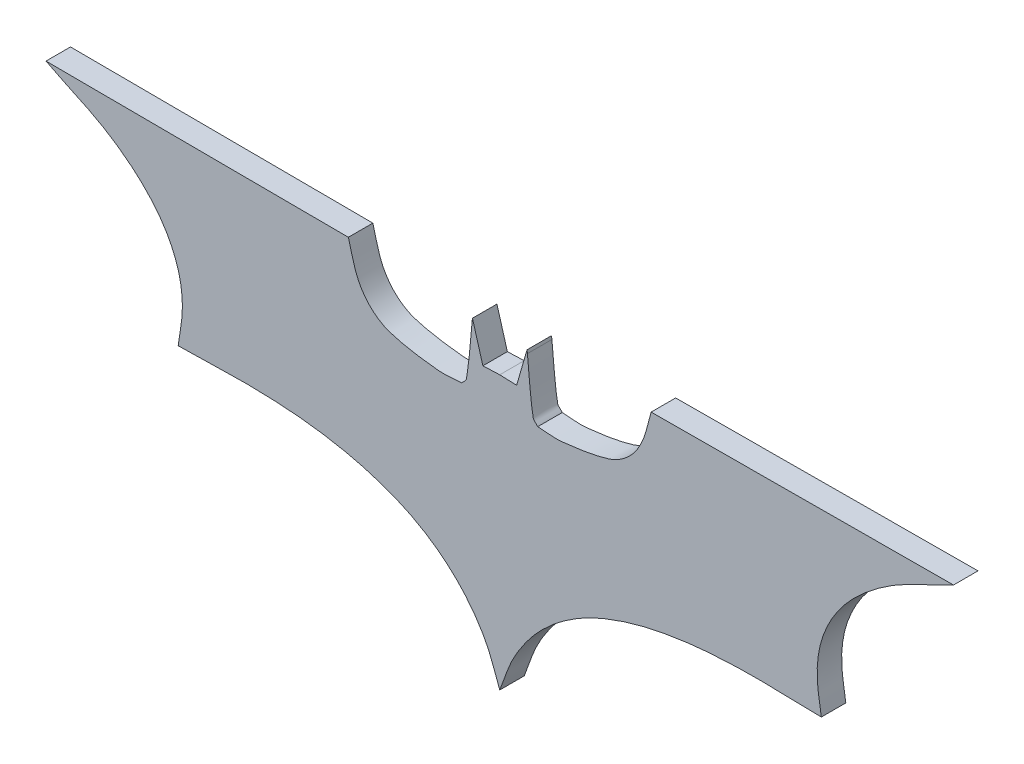
ISO-10303-21;
HEADER;
FILE_DESCRIPTION(('STEP AP214'),'2;1');
FILE_NAME('part.step','',(''),(''),'','','');
FILE_SCHEMA(('AUTOMOTIVE_DESIGN { 1 0 10303 214 1 1 1 1 }'));
ENDSEC;
DATA;
#1=APPLICATION_CONTEXT('core data for automotive mechanical design processes');
#2=APPLICATION_PROTOCOL_DEFINITION('international standard','automotive_design',2000,#1);
#3=PRODUCT_CONTEXT('',#1,'mechanical');
#4=PRODUCT('Part','Part','',(#3));
#5=PRODUCT_RELATED_PRODUCT_CATEGORY('part','',(#4));
#6=PRODUCT_DEFINITION_FORMATION('','',#4);
#7=PRODUCT_DEFINITION_CONTEXT('part definition',#1,'design');
#8=PRODUCT_DEFINITION('design','',#6,#7);
#9=PRODUCT_DEFINITION_SHAPE('','',#8);
#10=(LENGTH_UNIT() NAMED_UNIT(*) SI_UNIT(.MILLI.,.METRE.));
#11=(NAMED_UNIT(*) PLANE_ANGLE_UNIT() SI_UNIT($,.RADIAN.));
#12=(NAMED_UNIT(*) SI_UNIT($,.STERADIAN.) SOLID_ANGLE_UNIT());
#13=UNCERTAINTY_MEASURE_WITH_UNIT(LENGTH_MEASURE(1.E-05),#10,'distance_accuracy_value','');
#14=(GEOMETRIC_REPRESENTATION_CONTEXT(3) GLOBAL_UNCERTAINTY_ASSIGNED_CONTEXT((#13)) GLOBAL_UNIT_ASSIGNED_CONTEXT((#10,
#11,#12)) REPRESENTATION_CONTEXT('',''));
#15=CARTESIAN_POINT('',(0.,0.,0.));
#16=DIRECTION('',(0.,0.,1.));
#17=DIRECTION('',(1.,0.,0.));
#18=AXIS2_PLACEMENT_3D('',#15,#16,#17);
#19=CARTESIAN_POINT('',(-50.0196575999992,17.5172147999984,2.7));
#20=CARTESIAN_POINT('',(-47.951069389506,16.4033596097322,2.7));
#21=CARTESIAN_POINT('',(-45.7388572153468,15.5592460024985,2.7));
#22=CARTESIAN_POINT('',(-43.7155271999989,14.3651495999984,2.7));
#23=CARTESIAN_POINT('',(-42.356636192836,13.5631811367563,2.7));
#24=CARTESIAN_POINT('',(-41.0659253190486,12.6288164911137,2.7));
#25=CARTESIAN_POINT('',(-39.8917103999983,11.5747967999984,2.7));
#26=CARTESIAN_POINT('',(-38.865562425511,10.6536875945529,2.7));
#27=CARTESIAN_POINT('',(-37.9241877445944,9.61753156492984,2.7));
#28=CARTESIAN_POINT('',(-37.1530307999981,8.47440479999895,2.7));
#29=CARTESIAN_POINT('',(-36.4464875104717,7.42705827670198,2.7));
#30=CARTESIAN_POINT('',(-35.8773485350232,6.26952736412313,2.7));
#31=CARTESIAN_POINT('',(-35.4994883999984,5.06397359999823,2.7));
#32=CARTESIAN_POINT('',(-35.1454137112421,3.93430673587282,2.7));
#33=CARTESIAN_POINT('',(-34.9909774271611,2.73402391140777,2.7));
#34=CARTESIAN_POINT('',(-34.9827563999989,1.55019599999885,2.7));
#35=CARTESIAN_POINT('',(-34.973602445473,0.232026548197442,2.7));
#36=CARTESIAN_POINT('',(-35.2927955999993,-1.06791280000128,2.7));
#37=CARTESIAN_POINT('',(-35.4478151999986,-2.37696720000134,2.7));
#38=B_SPLINE_CURVE_WITH_KNOTS('',3,(#19,#20,#21,#22,#23,#24,#25,#26,#27,#28,#29,#30,#31,#32,#33,
#34,#35,#36,#37),.UNSPECIFIED.,.F.,.F.,(4,3,3,3,3,3,4),(0.,1.,2.,3.,4.,5.,6.),.UNSPECIFIED.);
#39=DIRECTION('',(0.,0.,-1.));
#40=VECTOR('',#39,1.);
#41=SURFACE_OF_LINEAR_EXTRUSION('',#38,#40);
#42=CARTESIAN_POINT('',(-50.0196575999992,17.5172147999984,0.));
#43=CARTESIAN_POINT('',(-47.951069389506,16.4033596097322,0.));
#44=CARTESIAN_POINT('',(-45.7388572153468,15.5592460024985,0.));
#45=CARTESIAN_POINT('',(-43.7155271999989,14.3651495999984,0.));
#46=CARTESIAN_POINT('',(-42.356636192836,13.5631811367563,0.));
#47=CARTESIAN_POINT('',(-41.0659253190486,12.6288164911137,0.));
#48=CARTESIAN_POINT('',(-39.8917103999983,11.5747967999984,0.));
#49=CARTESIAN_POINT('',(-38.865562425511,10.6536875945529,0.));
#50=CARTESIAN_POINT('',(-37.9241877445944,9.61753156492984,0.));
#51=CARTESIAN_POINT('',(-37.1530307999981,8.47440479999895,0.));
#52=CARTESIAN_POINT('',(-36.4464875104717,7.42705827670198,0.));
#53=CARTESIAN_POINT('',(-35.8773485350232,6.26952736412313,0.));
#54=CARTESIAN_POINT('',(-35.4994883999984,5.06397359999823,0.));
#55=CARTESIAN_POINT('',(-35.1454137112421,3.93430673587282,0.));
#56=CARTESIAN_POINT('',(-34.9909774271611,2.73402391140777,0.));
#57=CARTESIAN_POINT('',(-34.9827563999989,1.55019599999885,0.));
#58=CARTESIAN_POINT('',(-34.973602445473,0.232026548197442,0.));
#59=CARTESIAN_POINT('',(-35.2927955999993,-1.06791280000128,0.));
#60=CARTESIAN_POINT('',(-35.4478151999986,-2.37696720000134,0.));
#61=B_SPLINE_CURVE_WITH_KNOTS('',3,(#42,#43,#44,#45,#46,#47,#48,#49,#50,#51,#52,#53,#54,#55,#56,
#57,#58,#59,#60),.UNSPECIFIED.,.F.,.F.,(4,3,3,3,3,3,4),(0.,1.,2.,3.,4.,5.,6.),.UNSPECIFIED.);
#62=CARTESIAN_POINT('',(-50.0196575999992,17.5172147999984,0.));
#63=VERTEX_POINT('',#62);
#64=CARTESIAN_POINT('',(-35.4478151999986,-2.37696720000134,0.));
#65=VERTEX_POINT('',#64);
#66=EDGE_CURVE('E306',#63,#65,#61,.T.);
#67=ORIENTED_EDGE('',*,*,#66,.T.);
#68=DIRECTION('',(0.,0.,-1.));
#69=VECTOR('',#68,1.);
#70=CARTESIAN_POINT('',(-35.4478151999986,-2.37696720000134,2.7));
#71=LINE('',#70,#69);
#72=CARTESIAN_POINT('',(-35.4478151999986,-2.37696720000134,2.7));
#73=VERTEX_POINT('',#72);
#74=EDGE_CURVE('E11',#73,#65,#71,.T.);
#75=ORIENTED_EDGE('',*,*,#74,.F.);
#76=CARTESIAN_POINT('',(-50.0196575999992,17.5172147999984,2.7));
#77=VERTEX_POINT('',#76);
#78=EDGE_CURVE('E361',#77,#73,#38,.T.);
#79=ORIENTED_EDGE('',*,*,#78,.F.);
#80=DIRECTION('',(0.,0.,-1.));
#81=VECTOR('',#80,1.);
#82=CARTESIAN_POINT('',(-50.0196575999992,17.5172147999984,2.7));
#83=LINE('',#82,#81);
#84=EDGE_CURVE('E174',#77,#63,#83,.T.);
#85=ORIENTED_EDGE('',*,*,#84,.T.);
#86=EDGE_LOOP('',(#67,#75,#79,#85));
#87=FACE_BOUND('',#86,.T.);
#88=ADVANCED_FACE('F33',(#87),#41,.F.);
#89=CARTESIAN_POINT('',(-35.4478151999986,-2.37696720000134,2.7));
#90=CARTESIAN_POINT('',(-33.8976191999985,-2.34251840000209,2.7));
#91=CARTESIAN_POINT('',(-32.3469997935595,-2.32361346430963,2.7));
#92=CARTESIAN_POINT('',(-30.7972271999981,-2.27362080000092,2.7));
#93=CARTESIAN_POINT('',(-27.9902648164621,-2.18307362633795,2.7));
#94=CARTESIAN_POINT('',(-25.1720997002751,-2.23404563342598,2.7));
#95=CARTESIAN_POINT('',(-22.3744955999985,-2.48031359999999,2.7));
#96=CARTESIAN_POINT('',(-20.2194008332919,-2.67002264636627,2.7));
#97=CARTESIAN_POINT('',(-18.0707092248715,-3.00889189803087,2.7));
#98=CARTESIAN_POINT('',(-15.9670187999987,-3.5137775999998,2.7));
#99=CARTESIAN_POINT('',(-14.182113437518,-3.94215488699377,2.7));
#100=CARTESIAN_POINT('',(-12.4281696191586,-4.53140303156772,2.7));
#101=CARTESIAN_POINT('',(-10.748025599999,-5.27066639999816,2.7));
#102=CARTESIAN_POINT('',(-9.3986945570057,-5.86437205891464,2.7));
#103=CARTESIAN_POINT('',(-8.11526139251217,-6.62395158290117,2.7));
#104=CARTESIAN_POINT('',(-6.92420880000011,-7.49261399999888,2.7));
#105=CARTESIAN_POINT('',(-5.81115719659575,-8.30438847766988,2.7));
#106=CARTESIAN_POINT('',(-4.78204776100899,-9.24565551576826,2.7));
#107=CARTESIAN_POINT('',(-3.87548999999954,-10.2829667999988,2.7));
#108=CARTESIAN_POINT('',(-2.97940890784876,-11.3082903573649,2.7));
#109=CARTESIAN_POINT('',(-2.19322385616838,-12.4414061351481,2.7));
#110=CARTESIAN_POINT('',(-1.55019599999928,-13.6417247999989,2.7));
#111=CARTESIAN_POINT('',(-0.893173811593151,-14.8681662183576,2.7));
#112=CARTESIAN_POINT('',(-0.516731999998576,-16.2253847999998,2.7));
#113=CARTESIAN_POINT('',(8.88178419700125E-13,-17.5172147999984,2.7));
#114=B_SPLINE_CURVE_WITH_KNOTS('',3,(#89,#90,#91,#92,#93,#94,#95,#96,#97,#98,#99,#100,#101,#102,
#103,#104,#105,#106,#107,#108,#109,#110,#111,#112,#113),.UNSPECIFIED.,.F.,.F.,(4,3,3,3,3,3,3,3,
4),(0.,1.,2.,3.,4.,5.,6.,7.,8.),.UNSPECIFIED.);
#115=DIRECTION('',(0.,0.,-1.));
#116=VECTOR('',#115,1.);
#117=SURFACE_OF_LINEAR_EXTRUSION('',#114,#116);
#118=CARTESIAN_POINT('',(-35.4478151999986,-2.37696720000134,0.));
#119=CARTESIAN_POINT('',(-33.8976191999985,-2.34251840000209,0.));
#120=CARTESIAN_POINT('',(-32.3469997935595,-2.32361346430963,0.));
#121=CARTESIAN_POINT('',(-30.7972271999981,-2.27362080000092,0.));
#122=CARTESIAN_POINT('',(-27.9902648164621,-2.18307362633795,0.));
#123=CARTESIAN_POINT('',(-25.1720997002751,-2.23404563342598,0.));
#124=CARTESIAN_POINT('',(-22.3744955999985,-2.48031359999999,0.));
#125=CARTESIAN_POINT('',(-20.2194008332919,-2.67002264636627,0.));
#126=CARTESIAN_POINT('',(-18.0707092248715,-3.00889189803087,0.));
#127=CARTESIAN_POINT('',(-15.9670187999987,-3.5137775999998,0.));
#128=CARTESIAN_POINT('',(-14.182113437518,-3.94215488699377,0.));
#129=CARTESIAN_POINT('',(-12.4281696191586,-4.53140303156772,0.));
#130=CARTESIAN_POINT('',(-10.748025599999,-5.27066639999816,0.));
#131=CARTESIAN_POINT('',(-9.3986945570057,-5.86437205891464,0.));
#132=CARTESIAN_POINT('',(-8.11526139251217,-6.62395158290117,0.));
#133=CARTESIAN_POINT('',(-6.92420880000011,-7.49261399999888,0.));
#134=CARTESIAN_POINT('',(-5.81115719659575,-8.30438847766988,0.));
#135=CARTESIAN_POINT('',(-4.78204776100899,-9.24565551576826,0.));
#136=CARTESIAN_POINT('',(-3.87548999999954,-10.2829667999988,0.));
#137=CARTESIAN_POINT('',(-2.97940890784876,-11.3082903573649,0.));
#138=CARTESIAN_POINT('',(-2.19322385616838,-12.4414061351481,0.));
#139=CARTESIAN_POINT('',(-1.55019599999928,-13.6417247999989,0.));
#140=CARTESIAN_POINT('',(-0.893173811593151,-14.8681662183576,0.));
#141=CARTESIAN_POINT('',(-0.516731999998576,-16.2253847999998,0.));
#142=CARTESIAN_POINT('',(8.88178419700125E-13,-17.5172147999984,0.));
#143=B_SPLINE_CURVE_WITH_KNOTS('',3,(#118,#119,#120,#121,#122,#123,#124,#125,#126,#127,#128,
#129,#130,#131,#132,#133,#134,#135,#136,#137,#138,#139,#140,#141,#142),.UNSPECIFIED.,.F.,.F.,(4,
3,3,3,3,3,3,3,4),(0.,1.,2.,3.,4.,5.,6.,7.,8.),.UNSPECIFIED.);
#144=CARTESIAN_POINT('',(8.88178419700125E-13,-17.5172147999984,0.));
#145=VERTEX_POINT('',#144);
#146=EDGE_CURVE('E300',#65,#145,#143,.T.);
#147=ORIENTED_EDGE('',*,*,#146,.T.);
#148=DIRECTION('',(0.,0.,-1.));
#149=VECTOR('',#148,1.);
#150=CARTESIAN_POINT('',(8.88178419700125E-13,-17.5172147999984,2.7));
#151=LINE('',#150,#149);
#152=CARTESIAN_POINT('',(8.88178419700125E-13,-17.5172147999984,2.7));
#153=VERTEX_POINT('',#152);
#154=EDGE_CURVE('E42',#153,#145,#151,.T.);
#155=ORIENTED_EDGE('',*,*,#154,.F.);
#156=EDGE_CURVE('E117',#73,#153,#114,.T.);
#157=ORIENTED_EDGE('',*,*,#156,.F.);
#158=ORIENTED_EDGE('',*,*,#74,.T.);
#159=EDGE_LOOP('',(#147,#155,#157,#158));
#160=FACE_BOUND('',#159,.T.);
#161=ADVANCED_FACE('F389',(#160),#117,.F.);
#162=CARTESIAN_POINT('',(8.88178419700125E-13,-17.5172147999985,2.7));
#163=CARTESIAN_POINT('',(0.516732000000353,-16.2253847999998,2.7));
#164=CARTESIAN_POINT('',(0.893173811594927,-14.8681662183576,2.7));
#165=CARTESIAN_POINT('',(1.55019600000106,-13.6417247999989,2.7));
#166=CARTESIAN_POINT('',(2.19322385617016,-12.4414061351481,2.7));
#167=CARTESIAN_POINT('',(2.97940890785053,-11.3082903573649,2.7));
#168=CARTESIAN_POINT('',(3.87549000000131,-10.2829667999988,2.7));
#169=CARTESIAN_POINT('',(4.78204776101077,-9.24565551576827,2.7));
#170=CARTESIAN_POINT('',(5.81115719659753,-8.30438847766989,2.7));
#171=CARTESIAN_POINT('',(6.92420880000189,-7.49261399999889,2.7));
#172=CARTESIAN_POINT('',(8.11526139251395,-6.62395158290118,2.7));
#173=CARTESIAN_POINT('',(9.39869455700748,-5.86437205891465,2.7));
#174=CARTESIAN_POINT('',(10.7480256000008,-5.27066639999817,2.7));
#175=CARTESIAN_POINT('',(12.4281696191604,-4.53140303156773,2.7));
#176=CARTESIAN_POINT('',(14.1821134375197,-3.94215488699378,2.7));
#177=CARTESIAN_POINT('',(15.9670188000005,-3.51377759999982,2.7));
#178=CARTESIAN_POINT('',(18.0707092248733,-3.00889189803088,2.7));
#179=CARTESIAN_POINT('',(20.2194008332937,-2.67002264636628,2.7));
#180=CARTESIAN_POINT('',(22.3744956000003,-2.4803136,2.7));
#181=CARTESIAN_POINT('',(25.1720997002769,-2.23404563342599,2.7));
#182=CARTESIAN_POINT('',(27.9902648164638,-2.18307362633795,2.7));
#183=CARTESIAN_POINT('',(30.7972271999999,-2.27362080000092,2.7));
#184=CARTESIAN_POINT('',(32.3469997935613,-2.32361346430964,2.7));
#185=CARTESIAN_POINT('',(33.8976192000002,-2.3425184000021,2.7));
#186=CARTESIAN_POINT('',(35.4478152000004,-2.37696720000135,2.7));
#187=B_SPLINE_CURVE_WITH_KNOTS('',3,(#162,#163,#164,#165,#166,#167,#168,#169,#170,#171,#172,
#173,#174,#175,#176,#177,#178,#179,#180,#181,#182,#183,#184,#185,#186),.UNSPECIFIED.,.F.,.F.,(4,
3,3,3,3,3,3,3,4),(0.,1.,2.,3.,4.,5.,6.,7.,8.),.UNSPECIFIED.);
#188=DIRECTION('',(0.,0.,-1.));
#189=VECTOR('',#188,1.);
#190=SURFACE_OF_LINEAR_EXTRUSION('',#187,#189);
#191=CARTESIAN_POINT('',(8.88178419700125E-13,-17.5172147999985,0.));
#192=CARTESIAN_POINT('',(0.516732000000353,-16.2253847999998,0.));
#193=CARTESIAN_POINT('',(0.893173811594927,-14.8681662183576,0.));
#194=CARTESIAN_POINT('',(1.55019600000106,-13.6417247999989,0.));
#195=CARTESIAN_POINT('',(2.19322385617016,-12.4414061351481,0.));
#196=CARTESIAN_POINT('',(2.97940890785053,-11.3082903573649,0.));
#197=CARTESIAN_POINT('',(3.87549000000131,-10.2829667999988,0.));
#198=CARTESIAN_POINT('',(4.78204776101077,-9.24565551576827,0.));
#199=CARTESIAN_POINT('',(5.81115719659753,-8.30438847766989,0.));
#200=CARTESIAN_POINT('',(6.92420880000189,-7.49261399999889,0.));
#201=CARTESIAN_POINT('',(8.11526139251395,-6.62395158290118,0.));
#202=CARTESIAN_POINT('',(9.39869455700748,-5.86437205891465,0.));
#203=CARTESIAN_POINT('',(10.7480256000008,-5.27066639999817,0.));
#204=CARTESIAN_POINT('',(12.4281696191604,-4.53140303156773,0.));
#205=CARTESIAN_POINT('',(14.1821134375197,-3.94215488699378,0.));
#206=CARTESIAN_POINT('',(15.9670188000005,-3.51377759999982,0.));
#207=CARTESIAN_POINT('',(18.0707092248733,-3.00889189803088,0.));
#208=CARTESIAN_POINT('',(20.2194008332937,-2.67002264636628,0.));
#209=CARTESIAN_POINT('',(22.3744956000003,-2.4803136,0.));
#210=CARTESIAN_POINT('',(25.1720997002769,-2.23404563342599,0.));
#211=CARTESIAN_POINT('',(27.9902648164638,-2.18307362633795,0.));
#212=CARTESIAN_POINT('',(30.7972271999999,-2.27362080000092,0.));
#213=CARTESIAN_POINT('',(32.3469997935613,-2.32361346430964,0.));
#214=CARTESIAN_POINT('',(33.8976192000002,-2.3425184000021,0.));
#215=CARTESIAN_POINT('',(35.4478152000004,-2.37696720000135,0.));
#216=B_SPLINE_CURVE_WITH_KNOTS('',3,(#191,#192,#193,#194,#195,#196,#197,#198,#199,#200,#201,
#202,#203,#204,#205,#206,#207,#208,#209,#210,#211,#212,#213,#214,#215),.UNSPECIFIED.,.F.,.F.,(4,
3,3,3,3,3,3,3,4),(0.,1.,2.,3.,4.,5.,6.,7.,8.),.UNSPECIFIED.);
#217=CARTESIAN_POINT('',(35.4478152000004,-2.37696720000135,0.));
#218=VERTEX_POINT('',#217);
#219=EDGE_CURVE('E294',#145,#218,#216,.T.);
#220=ORIENTED_EDGE('',*,*,#219,.T.);
#221=DIRECTION('',(0.,0.,-1.));
#222=VECTOR('',#221,1.);
#223=CARTESIAN_POINT('',(35.4478152000004,-2.37696720000135,2.7));
#224=LINE('',#223,#222);
#225=CARTESIAN_POINT('',(35.4478152000004,-2.37696720000135,2.7));
#226=VERTEX_POINT('',#225);
#227=EDGE_CURVE('E286',#226,#218,#224,.T.);
#228=ORIENTED_EDGE('',*,*,#227,.F.);
#229=EDGE_CURVE('E295',#153,#226,#187,.T.);
#230=ORIENTED_EDGE('',*,*,#229,.F.);
#231=ORIENTED_EDGE('',*,*,#154,.T.);
#232=EDGE_LOOP('',(#220,#228,#230,#231));
#233=FACE_BOUND('',#232,.T.);
#234=ADVANCED_FACE('F292',(#233),#190,.F.);
#235=CARTESIAN_POINT('',(35.4478152000004,-2.37696720000135,2.7));
#236=CARTESIAN_POINT('',(35.2927956000011,-1.06791280000128,2.7));
#237=CARTESIAN_POINT('',(34.9736024454748,0.232026548197435,2.7));
#238=CARTESIAN_POINT('',(34.9827564000007,1.55019599999884,2.7));
#239=CARTESIAN_POINT('',(34.9909774271628,2.73402391140776,2.7));
#240=CARTESIAN_POINT('',(35.1454137112439,3.93430673587281,2.7));
#241=CARTESIAN_POINT('',(35.4994884000002,5.06397359999822,2.7));
#242=CARTESIAN_POINT('',(35.877348535025,6.26952736412312,2.7));
#243=CARTESIAN_POINT('',(36.4464875104735,7.42705827670198,2.7));
#244=CARTESIAN_POINT('',(37.1530307999999,8.47440479999895,2.7));
#245=CARTESIAN_POINT('',(37.9241877445962,9.61753156492984,2.7));
#246=CARTESIAN_POINT('',(38.8655624255128,10.6536875945529,2.7));
#247=CARTESIAN_POINT('',(39.8917104000001,11.5747967999984,2.7));
#248=CARTESIAN_POINT('',(41.0659253190504,12.6288164911137,2.7));
#249=CARTESIAN_POINT('',(42.3566361928378,13.5631811367563,2.7));
#250=CARTESIAN_POINT('',(43.7155272000007,14.3651495999984,2.7));
#251=CARTESIAN_POINT('',(45.7388572153485,15.5592460024985,2.7));
#252=CARTESIAN_POINT('',(47.9510693895078,16.4033596097322,2.7));
#253=CARTESIAN_POINT('',(50.0196576000009,17.5172147999985,2.7));
#254=B_SPLINE_CURVE_WITH_KNOTS('',3,(#235,#236,#237,#238,#239,#240,#241,#242,#243,#244,#245,
#246,#247,#248,#249,#250,#251,#252,#253),.UNSPECIFIED.,.F.,.F.,(4,3,3,3,3,3,4),(0.,1.,2.,3.,4.,
5.,6.),.UNSPECIFIED.);
#255=DIRECTION('',(0.,0.,-1.));
#256=VECTOR('',#255,1.);
#257=SURFACE_OF_LINEAR_EXTRUSION('',#254,#256);
#258=CARTESIAN_POINT('',(35.4478152000004,-2.37696720000135,0.));
#259=CARTESIAN_POINT('',(35.2927956000011,-1.06791280000128,0.));
#260=CARTESIAN_POINT('',(34.9736024454748,0.232026548197435,0.));
#261=CARTESIAN_POINT('',(34.9827564000007,1.55019599999884,0.));
#262=CARTESIAN_POINT('',(34.9909774271628,2.73402391140776,0.));
#263=CARTESIAN_POINT('',(35.1454137112439,3.93430673587281,0.));
#264=CARTESIAN_POINT('',(35.4994884000002,5.06397359999822,0.));
#265=CARTESIAN_POINT('',(35.877348535025,6.26952736412312,0.));
#266=CARTESIAN_POINT('',(36.4464875104735,7.42705827670198,0.));
#267=CARTESIAN_POINT('',(37.1530307999999,8.47440479999895,0.));
#268=CARTESIAN_POINT('',(37.9241877445962,9.61753156492984,0.));
#269=CARTESIAN_POINT('',(38.8655624255128,10.6536875945529,0.));
#270=CARTESIAN_POINT('',(39.8917104000001,11.5747967999984,0.));
#271=CARTESIAN_POINT('',(41.0659253190504,12.6288164911137,0.));
#272=CARTESIAN_POINT('',(42.3566361928378,13.5631811367563,0.));
#273=CARTESIAN_POINT('',(43.7155272000007,14.3651495999984,0.));
#274=CARTESIAN_POINT('',(45.7388572153485,15.5592460024985,0.));
#275=CARTESIAN_POINT('',(47.9510693895078,16.4033596097322,0.));
#276=CARTESIAN_POINT('',(50.0196576000009,17.5172147999985,0.));
#277=B_SPLINE_CURVE_WITH_KNOTS('',3,(#258,#259,#260,#261,#262,#263,#264,#265,#266,#267,#268,
#269,#270,#271,#272,#273,#274,#275,#276),.UNSPECIFIED.,.F.,.F.,(4,3,3,3,3,3,4),(0.,1.,2.,3.,4.,
5.,6.),.UNSPECIFIED.);
#278=CARTESIAN_POINT('',(50.0196576000009,17.5172147999985,0.));
#279=VERTEX_POINT('',#278);
#280=EDGE_CURVE('E302',#218,#279,#277,.T.);
#281=ORIENTED_EDGE('',*,*,#280,.T.);
#282=DIRECTION('',(0.,0.,-1.));
#283=VECTOR('',#282,1.);
#284=CARTESIAN_POINT('',(50.0196576000009,17.5172147999985,2.7));
#285=LINE('',#284,#283);
#286=CARTESIAN_POINT('',(50.0196576000009,17.5172147999985,2.7));
#287=VERTEX_POINT('',#286);
#288=EDGE_CURVE('E283',#287,#279,#285,.T.);
#289=ORIENTED_EDGE('',*,*,#288,.F.);
#290=EDGE_CURVE('E398',#226,#287,#254,.T.);
#291=ORIENTED_EDGE('',*,*,#290,.F.);
#292=ORIENTED_EDGE('',*,*,#227,.T.);
#293=EDGE_LOOP('',(#281,#289,#291,#292));
#294=FACE_BOUND('',#293,.T.);
#295=ADVANCED_FACE('F394',(#294),#257,.F.);
#296=CARTESIAN_POINT('',(50.0196576000009,17.5172147999985,2.7));
#297=DIRECTION('',(0.00465111248148392,-0.999989183517844,0.));
#298=DIRECTION('',(0.999989183517844,0.00465111248148392,0.));
#299=AXIS2_PLACEMENT_3D('',#296,#297,#298);
#300=PLANE('',#299);
#301=DIRECTION('',(-0.999989183517844,-0.00465111248148392,0.));
#302=VECTOR('',#301,1.);
#303=CARTESIAN_POINT('',(50.0196576000009,17.5172147999985,0.));
#304=LINE('',#303,#302);
#305=CARTESIAN_POINT('',(16.690443599999,17.3621951999983,0.));
#306=VERTEX_POINT('',#305);
#307=EDGE_CURVE('E304',#279,#306,#304,.T.);
#308=ORIENTED_EDGE('',*,*,#307,.T.);
#309=DIRECTION('',(0.,0.,-1.));
#310=VECTOR('',#309,1.);
#311=CARTESIAN_POINT('',(16.690443599999,17.3621951999983,2.7));
#312=LINE('',#311,#310);
#313=CARTESIAN_POINT('',(16.690443599999,17.3621951999983,2.7));
#314=VERTEX_POINT('',#313);
#315=EDGE_CURVE('E280',#314,#306,#312,.T.);
#316=ORIENTED_EDGE('',*,*,#315,.F.);
#317=DIRECTION('',(-0.999989183517844,-0.00465111248148392,0.));
#318=VECTOR('',#317,1.);
#319=CARTESIAN_POINT('',(50.0196576000009,17.5172147999985,2.7));
#320=LINE('',#319,#318);
#321=EDGE_CURVE('E402',#287,#314,#320,.T.);
#322=ORIENTED_EDGE('',*,*,#321,.F.);
#323=ORIENTED_EDGE('',*,*,#288,.T.);
#324=EDGE_LOOP('',(#308,#316,#322,#323));
#325=FACE_BOUND('',#324,.T.);
#326=ADVANCED_FACE('F396',(#325),#300,.F.);
#327=CARTESIAN_POINT('',(16.690443599999,17.3621951999983,2.7));
#328=CARTESIAN_POINT('',(16.3459555999994,16.225384799998,2.7));
#329=CARTESIAN_POINT('',(16.1515592225649,15.0317644002924,2.7));
#330=CARTESIAN_POINT('',(15.6569796000001,13.9517639999984,2.7));
#331=CARTESIAN_POINT('',(15.2968259363808,13.1653059998489,2.7));
#332=CARTESIAN_POINT('',(14.7920060467532,12.4220959026142,2.7));
#333=CARTESIAN_POINT('',(14.1584567999997,11.8331627999981,2.7));
#334=CARTESIAN_POINT('',(13.5418392055238,11.2599689797803,2.7));
#335=CARTESIAN_POINT('',(12.7939334960745,10.7853278502179,2.7));
#336=CARTESIAN_POINT('',(11.9881824000005,10.5413327999986,2.7));
#337=CARTESIAN_POINT('',(10.3131746221097,10.0341121348628,2.7));
#338=CARTESIAN_POINT('',(8.56124065316077,9.79562614073037,2.7));
#339=CARTESIAN_POINT('',(6.82086240000057,9.61121519999919,2.7));
#340=CARTESIAN_POINT('',(5.94663681205265,9.51858202511646,2.7));
#341=CARTESIAN_POINT('',(5.06397359999955,9.68011279999859,2.7));
#342=CARTESIAN_POINT('',(4.18552919999993,9.71456159999873,2.7));
#343=B_SPLINE_CURVE_WITH_KNOTS('',3,(#327,#328,#329,#330,#331,#332,#333,#334,#335,#336,#337,
#338,#339,#340,#341,#342),.UNSPECIFIED.,.F.,.F.,(4,3,3,3,3,4),(0.,1.,2.,3.,4.,5.),.UNSPECIFIED.);
#344=DIRECTION('',(0.,0.,-1.));
#345=VECTOR('',#344,1.);
#346=SURFACE_OF_LINEAR_EXTRUSION('',#343,#345);
#347=CARTESIAN_POINT('',(16.690443599999,17.3621951999983,0.));
#348=CARTESIAN_POINT('',(16.3459555999994,16.225384799998,0.));
#349=CARTESIAN_POINT('',(16.1515592225649,15.0317644002924,0.));
#350=CARTESIAN_POINT('',(15.6569796000001,13.9517639999984,0.));
#351=CARTESIAN_POINT('',(15.2968259363808,13.1653059998489,0.));
#352=CARTESIAN_POINT('',(14.7920060467532,12.4220959026142,0.));
#353=CARTESIAN_POINT('',(14.1584567999997,11.8331627999981,0.));
#354=CARTESIAN_POINT('',(13.5418392055238,11.2599689797803,0.));
#355=CARTESIAN_POINT('',(12.7939334960745,10.7853278502179,0.));
#356=CARTESIAN_POINT('',(11.9881824000005,10.5413327999986,0.));
#357=CARTESIAN_POINT('',(10.3131746221097,10.0341121348628,0.));
#358=CARTESIAN_POINT('',(8.56124065316077,9.79562614073037,0.));
#359=CARTESIAN_POINT('',(6.82086240000057,9.61121519999919,0.));
#360=CARTESIAN_POINT('',(5.94663681205265,9.51858202511646,0.));
#361=CARTESIAN_POINT('',(5.06397359999955,9.68011279999859,0.));
#362=CARTESIAN_POINT('',(4.18552919999993,9.71456159999873,0.));
#363=B_SPLINE_CURVE_WITH_KNOTS('',3,(#347,#348,#349,#350,#351,#352,#353,#354,#355,#356,#357,
#358,#359,#360,#361,#362),.UNSPECIFIED.,.F.,.F.,(4,3,3,3,3,4),(0.,1.,2.,3.,4.,5.),.UNSPECIFIED.);
#364=CARTESIAN_POINT('',(4.18552919999993,9.71456159999873,0.));
#365=VERTEX_POINT('',#364);
#366=EDGE_CURVE('E322',#306,#365,#363,.T.);
#367=ORIENTED_EDGE('',*,*,#366,.T.);
#368=DIRECTION('',(0.,0.,-1.));
#369=VECTOR('',#368,1.);
#370=CARTESIAN_POINT('',(4.18552919999993,9.71456159999873,2.7));
#371=LINE('',#370,#369);
#372=CARTESIAN_POINT('',(4.18552919999993,9.71456159999873,2.7));
#373=VERTEX_POINT('',#372);
#374=EDGE_CURVE('E277',#373,#365,#371,.T.);
#375=ORIENTED_EDGE('',*,*,#374,.F.);
#376=EDGE_CURVE('E233',#314,#373,#343,.T.);
#377=ORIENTED_EDGE('',*,*,#376,.F.);
#378=ORIENTED_EDGE('',*,*,#315,.T.);
#379=EDGE_LOOP('',(#367,#375,#377,#378));
#380=FACE_BOUND('',#379,.T.);
#381=ADVANCED_FACE('F223',(#380),#346,.F.);
#382=CARTESIAN_POINT('',(4.18552919999993,9.71456159999873,2.7));
#383=CARTESIAN_POINT('',(4.01328520000011,9.93847879999832,2.7));
#384=CARTESIAN_POINT('',(3.71814767439904,10.1081559806633,2.7));
#385=CARTESIAN_POINT('',(3.66879720000046,10.3863131999984,2.7));
#386=CARTESIAN_POINT('',(3.3328574975231,12.2797915230488,2.7));
#387=CARTESIAN_POINT('',(3.25541160000054,14.2101299999982,2.7));
#388=CARTESIAN_POINT('',(3.04871879999968,16.1220383999985,2.7));
#389=B_SPLINE_CURVE_WITH_KNOTS('',3,(#382,#383,#384,#385,#386,#387,#388),.UNSPECIFIED.,.F.,.F.,
(4,3,4),(0.,1.,2.),.UNSPECIFIED.);
#390=DIRECTION('',(0.,0.,-1.));
#391=VECTOR('',#390,1.);
#392=SURFACE_OF_LINEAR_EXTRUSION('',#389,#391);
#393=CARTESIAN_POINT('',(4.18552919999993,9.71456159999873,0.));
#394=CARTESIAN_POINT('',(4.01328520000011,9.93847879999832,0.));
#395=CARTESIAN_POINT('',(3.71814767439904,10.1081559806633,0.));
#396=CARTESIAN_POINT('',(3.66879720000046,10.3863131999984,0.));
#397=CARTESIAN_POINT('',(3.3328574975231,12.2797915230488,0.));
#398=CARTESIAN_POINT('',(3.25541160000054,14.2101299999982,0.));
#399=CARTESIAN_POINT('',(3.04871879999968,16.1220383999985,0.));
#400=B_SPLINE_CURVE_WITH_KNOTS('',3,(#393,#394,#395,#396,#397,#398,#399),.UNSPECIFIED.,.F.,.F.,
(4,3,4),(0.,1.,2.),.UNSPECIFIED.);
#401=CARTESIAN_POINT('',(3.04871879999968,16.1220383999985,0.));
#402=VERTEX_POINT('',#401);
#403=EDGE_CURVE('E326',#365,#402,#400,.T.);
#404=ORIENTED_EDGE('',*,*,#403,.T.);
#405=DIRECTION('',(0.,0.,-1.));
#406=VECTOR('',#405,1.);
#407=CARTESIAN_POINT('',(3.04871879999968,16.1220383999985,2.7));
#408=LINE('',#407,#406);
#409=CARTESIAN_POINT('',(3.04871879999968,16.1220383999985,2.7));
#410=VERTEX_POINT('',#409);
#411=EDGE_CURVE('E274',#410,#402,#408,.T.);
#412=ORIENTED_EDGE('',*,*,#411,.F.);
#413=EDGE_CURVE('E227',#373,#410,#389,.T.);
#414=ORIENTED_EDGE('',*,*,#413,.F.);
#415=ORIENTED_EDGE('',*,*,#374,.T.);
#416=EDGE_LOOP('',(#404,#412,#414,#415));
#417=FACE_BOUND('',#416,.T.);
#418=ADVANCED_FACE('F218',(#417),#392,.F.);
#419=CARTESIAN_POINT('',(3.01067593228323,16.4739349263743,2.7));
#420=DIRECTION('',(-0.994207047565803,-0.107481842980517,0.));
#421=DIRECTION('',(0.107481842980517,-0.994207047565803,0.));
#422=AXIS2_PLACEMENT_3D('',#419,#420,#421);
#423=PLANE('',#422);
#424=DIRECTION('',(-0.107481842980517,0.994207047565803,0.));
#425=VECTOR('',#424,1.);
#426=CARTESIAN_POINT('',(3.01067593228323,16.4739349263743,0.));
#427=LINE('',#426,#425);
#428=CARTESIAN_POINT('',(3.01067593228323,16.4739349263743,0.));
#429=VERTEX_POINT('',#428);
#430=EDGE_CURVE('E333',#402,#429,#427,.T.);
#431=ORIENTED_EDGE('',*,*,#430,.T.);
#432=DIRECTION('',(0.,0.,-1.));
#433=VECTOR('',#432,1.);
#434=CARTESIAN_POINT('',(3.01067593228323,16.4739349263743,2.7));
#435=LINE('',#434,#433);
#436=CARTESIAN_POINT('',(3.01067593228323,16.4739349263743,2.7));
#437=VERTEX_POINT('',#436);
#438=EDGE_CURVE('E271',#437,#429,#435,.T.);
#439=ORIENTED_EDGE('',*,*,#438,.F.);
#440=DIRECTION('',(-0.107481842980517,0.994207047565803,0.));
#441=VECTOR('',#440,1.);
#442=CARTESIAN_POINT('',(3.01067593228323,16.4739349263743,2.7));
#443=LINE('',#442,#441);
#444=EDGE_CURVE('E232',#410,#437,#443,.T.);
#445=ORIENTED_EDGE('',*,*,#444,.F.);
#446=ORIENTED_EDGE('',*,*,#411,.T.);
#447=EDGE_LOOP('',(#431,#439,#445,#446));
#448=FACE_BOUND('',#447,.T.);
#449=ADVANCED_FACE('F214',(#448),#423,.F.);
#450=CARTESIAN_POINT('',(2.89369920000038,16.0703651999987,2.7));
#451=DIRECTION('',(0.960466366084557,-0.278396048140639,0.));
#452=DIRECTION('',(0.278396048140639,0.960466366084557,0.));
#453=AXIS2_PLACEMENT_3D('',#450,#451,#452);
#454=PLANE('',#453);
#455=DIRECTION('',(-0.278396048140639,-0.960466366084557,0.));
#456=VECTOR('',#455,1.);
#457=CARTESIAN_POINT('',(2.89369920000038,16.0703651999987,0.));
#458=LINE('',#457,#456);
#459=CARTESIAN_POINT('',(1.86023519999967,12.5049143999987,0.));
#460=VERTEX_POINT('',#459);
#461=EDGE_CURVE('E339',#429,#460,#458,.T.);
#462=ORIENTED_EDGE('',*,*,#461,.T.);
#463=DIRECTION('',(0.,0.,-1.));
#464=VECTOR('',#463,1.);
#465=CARTESIAN_POINT('',(1.86023519999967,12.5049143999987,2.7));
#466=LINE('',#465,#464);
#467=CARTESIAN_POINT('',(1.86023519999967,12.5049143999987,2.7));
#468=VERTEX_POINT('',#467);
#469=EDGE_CURVE('E268',#468,#460,#466,.T.);
#470=ORIENTED_EDGE('',*,*,#469,.F.);
#471=DIRECTION('',(-0.278396048140639,-0.960466366084557,0.));
#472=VECTOR('',#471,1.);
#473=CARTESIAN_POINT('',(3.01067593228323,16.4739349263743,2.7));
#474=LINE('',#473,#472);
#475=EDGE_CURVE('E242',#437,#468,#474,.T.);
#476=ORIENTED_EDGE('',*,*,#475,.F.);
#477=ORIENTED_EDGE('',*,*,#438,.T.);
#478=EDGE_LOOP('',(#462,#470,#476,#477));
#479=FACE_BOUND('',#478,.T.);
#480=ADVANCED_FACE('F210',(#479),#454,.F.);
#481=CARTESIAN_POINT('',(1.86023519999967,12.5049143999987,2.7));
#482=DIRECTION('',(-0.0384331221014243,-0.999261174631306,0.));
#483=DIRECTION('',(0.999261174631306,-0.0384331221014243,0.));
#484=AXIS2_PLACEMENT_3D('',#481,#482,#483);
#485=PLANE('',#484);
#486=DIRECTION('',(-0.999261174631306,0.0384331221014243,0.));
#487=VECTOR('',#486,1.);
#488=CARTESIAN_POINT('',(1.86023519999967,12.5049143999987,0.));
#489=LINE('',#488,#487);
#490=CARTESIAN_POINT('',(8.88178419700125E-13,12.5764619076913,0.));
#491=VERTEX_POINT('',#490);
#492=EDGE_CURVE('E341',#460,#491,#489,.T.);
#493=ORIENTED_EDGE('',*,*,#492,.T.);
#494=DIRECTION('',(0.,0.,-1.));
#495=VECTOR('',#494,1.);
#496=CARTESIAN_POINT('',(8.88178419700125E-13,12.5764619076913,2.7));
#497=LINE('',#496,#495);
#498=CARTESIAN_POINT('',(8.88178419700125E-13,12.5764619076913,2.7));
#499=VERTEX_POINT('',#498);
#500=EDGE_CURVE('E265',#499,#491,#497,.T.);
#501=ORIENTED_EDGE('',*,*,#500,.F.);
#502=DIRECTION('',(-0.999261174631306,0.0384331221014243,0.));
#503=VECTOR('',#502,1.);
#504=CARTESIAN_POINT('',(1.86023519999967,12.5049143999987,2.7));
#505=LINE('',#504,#503);
#506=EDGE_CURVE('E244',#468,#499,#505,.T.);
#507=ORIENTED_EDGE('',*,*,#506,.F.);
#508=ORIENTED_EDGE('',*,*,#469,.T.);
#509=EDGE_LOOP('',(#493,#501,#507,#508));
#510=FACE_BOUND('',#509,.T.);
#511=ADVANCED_FACE('F206',(#510),#485,.F.);
#512=CARTESIAN_POINT('',(-1.86023519999789,12.5049143999987,2.7));
#513=DIRECTION('',(0.0384331221014243,-0.999261174631306,0.));
#514=DIRECTION('',(0.999261174631306,0.0384331221014243,0.));
#515=AXIS2_PLACEMENT_3D('',#512,#513,#514);
#516=PLANE('',#515);
#517=DIRECTION('',(-0.999261174631306,-0.0384331221014243,0.));
#518=VECTOR('',#517,1.);
#519=CARTESIAN_POINT('',(-1.86023519999789,12.5049143999987,0.));
#520=LINE('',#519,#518);
#521=CARTESIAN_POINT('',(-1.86023519999789,12.5049143999987,0.));
#522=VERTEX_POINT('',#521);
#523=EDGE_CURVE('E343',#491,#522,#520,.T.);
#524=ORIENTED_EDGE('',*,*,#523,.T.);
#525=DIRECTION('',(0.,0.,-1.));
#526=VECTOR('',#525,1.);
#527=CARTESIAN_POINT('',(-1.86023519999789,12.5049143999987,2.7));
#528=LINE('',#527,#526);
#529=CARTESIAN_POINT('',(-1.86023519999789,12.5049143999987,2.7));
#530=VERTEX_POINT('',#529);
#531=EDGE_CURVE('E258',#530,#522,#528,.T.);
#532=ORIENTED_EDGE('',*,*,#531,.F.);
#533=DIRECTION('',(-0.999261174631306,-0.0384331221014243,0.));
#534=VECTOR('',#533,1.);
#535=CARTESIAN_POINT('',(-1.86023519999789,12.5049143999987,2.7));
#536=LINE('',#535,#534);
#537=EDGE_CURVE('E246',#499,#530,#536,.T.);
#538=ORIENTED_EDGE('',*,*,#537,.F.);
#539=ORIENTED_EDGE('',*,*,#500,.T.);
#540=EDGE_LOOP('',(#524,#532,#538,#539));
#541=FACE_BOUND('',#540,.T.);
#542=ADVANCED_FACE('F202',(#541),#516,.F.);
#543=CARTESIAN_POINT('',(-3.01067593228145,16.4739349263743,2.7));
#544=DIRECTION('',(-0.960466366084557,-0.278396048140641,0.));
#545=DIRECTION('',(0.278396048140641,-0.960466366084557,0.));
#546=AXIS2_PLACEMENT_3D('',#543,#544,#545);
#547=PLANE('',#546);
#548=DIRECTION('',(-0.278396048140641,0.960466366084557,0.));
#549=VECTOR('',#548,1.);
#550=CARTESIAN_POINT('',(-3.01067593228145,16.4739349263743,0.));
#551=LINE('',#550,#549);
#552=CARTESIAN_POINT('',(-3.01067593228145,16.4739349263743,0.));
#553=VERTEX_POINT('',#552);
#554=EDGE_CURVE('E256',#522,#553,#551,.T.);
#555=ORIENTED_EDGE('',*,*,#554,.T.);
#556=DIRECTION('',(0.,0.,-1.));
#557=VECTOR('',#556,1.);
#558=CARTESIAN_POINT('',(-3.01067593228145,16.4739349263743,2.7));
#559=LINE('',#558,#557);
#560=CARTESIAN_POINT('',(-3.01067593228145,16.4739349263743,2.7));
#561=VERTEX_POINT('',#560);
#562=EDGE_CURVE('E255',#561,#553,#559,.T.);
#563=ORIENTED_EDGE('',*,*,#562,.F.);
#564=DIRECTION('',(-0.278396048140639,0.960466366084557,0.));
#565=VECTOR('',#564,1.);
#566=CARTESIAN_POINT('',(-2.8936991999986,16.0703651999987,2.7));
#567=LINE('',#566,#565);
#568=EDGE_CURVE('E248',#530,#561,#567,.T.);
#569=ORIENTED_EDGE('',*,*,#568,.F.);
#570=ORIENTED_EDGE('',*,*,#531,.T.);
#571=EDGE_LOOP('',(#555,#563,#569,#570));
#572=FACE_BOUND('',#571,.T.);
#573=ADVANCED_FACE('F198',(#572),#547,.F.);
#574=CARTESIAN_POINT('',(-3.01067593228145,16.4739349263743,2.7));
#575=DIRECTION('',(0.994207047565803,-0.107481842980518,0.));
#576=DIRECTION('',(0.107481842980518,0.994207047565803,0.));
#577=AXIS2_PLACEMENT_3D('',#574,#575,#576);
#578=PLANE('',#577);
#579=DIRECTION('',(-0.107481842980518,-0.994207047565803,0.));
#580=VECTOR('',#579,1.);
#581=CARTESIAN_POINT('',(-3.01067593228145,16.4739349263743,0.));
#582=LINE('',#581,#580);
#583=CARTESIAN_POINT('',(-3.04871879999791,16.1220383999985,0.));
#584=VERTEX_POINT('',#583);
#585=EDGE_CURVE('E260',#553,#584,#582,.T.);
#586=ORIENTED_EDGE('',*,*,#585,.T.);
#587=DIRECTION('',(0.,0.,-1.));
#588=VECTOR('',#587,1.);
#589=CARTESIAN_POINT('',(-3.04871879999791,16.1220383999985,2.7));
#590=LINE('',#589,#588);
#591=CARTESIAN_POINT('',(-3.04871879999791,16.1220383999985,2.7));
#592=VERTEX_POINT('',#591);
#593=EDGE_CURVE('E169',#592,#584,#590,.T.);
#594=ORIENTED_EDGE('',*,*,#593,.F.);
#595=DIRECTION('',(-0.107481842980518,-0.994207047565803,0.));
#596=VECTOR('',#595,1.);
#597=CARTESIAN_POINT('',(-3.01067593228145,16.4739349263743,2.7));
#598=LINE('',#597,#596);
#599=EDGE_CURVE('E160',#561,#592,#598,.T.);
#600=ORIENTED_EDGE('',*,*,#599,.F.);
#601=ORIENTED_EDGE('',*,*,#562,.T.);
#602=EDGE_LOOP('',(#586,#594,#600,#601));
#603=FACE_BOUND('',#602,.T.);
#604=ADVANCED_FACE('F195',(#603),#578,.F.);
#605=CARTESIAN_POINT('',(-3.04871879999791,16.1220383999985,2.7));
#606=CARTESIAN_POINT('',(-3.25541159999876,14.2101299999982,2.7));
#607=CARTESIAN_POINT('',(-3.33285749752132,12.2797915230488,2.7));
#608=CARTESIAN_POINT('',(-3.66879719999869,10.3863131999984,2.7));
#609=CARTESIAN_POINT('',(-3.71814767439727,10.1081559806633,2.7));
#610=CARTESIAN_POINT('',(-4.01328519999833,9.93847879999832,2.7));
#611=CARTESIAN_POINT('',(-4.18552919999815,9.71456159999873,2.7));
#612=B_SPLINE_CURVE_WITH_KNOTS('',3,(#605,#606,#607,#608,#609,#610,#611),.UNSPECIFIED.,.F.,.F.,
(4,3,4),(0.,1.,2.),.UNSPECIFIED.);
#613=DIRECTION('',(0.,0.,-1.));
#614=VECTOR('',#613,1.);
#615=SURFACE_OF_LINEAR_EXTRUSION('',#612,#614);
#616=CARTESIAN_POINT('',(-3.04871879999791,16.1220383999985,0.));
#617=CARTESIAN_POINT('',(-3.25541159999876,14.2101299999982,0.));
#618=CARTESIAN_POINT('',(-3.33285749752132,12.2797915230488,0.));
#619=CARTESIAN_POINT('',(-3.66879719999869,10.3863131999984,0.));
#620=CARTESIAN_POINT('',(-3.71814767439727,10.1081559806633,0.));
#621=CARTESIAN_POINT('',(-4.01328519999833,9.93847879999832,0.));
#622=CARTESIAN_POINT('',(-4.18552919999815,9.71456159999873,0.));
#623=B_SPLINE_CURVE_WITH_KNOTS('',3,(#616,#617,#618,#619,#620,#621,#622),.UNSPECIFIED.,.F.,.F.,
(4,3,4),(0.,1.,2.),.UNSPECIFIED.);
#624=CARTESIAN_POINT('',(-4.18552919999815,9.71456159999873,0.));
#625=VERTEX_POINT('',#624);
#626=EDGE_CURVE('E168',#584,#625,#623,.T.);
#627=ORIENTED_EDGE('',*,*,#626,.T.);
#628=DIRECTION('',(0.,0.,-1.));
#629=VECTOR('',#628,1.);
#630=CARTESIAN_POINT('',(-4.18552919999815,9.71456159999873,2.7));
#631=LINE('',#630,#629);
#632=CARTESIAN_POINT('',(-4.18552919999815,9.71456159999873,2.7));
#633=VERTEX_POINT('',#632);
#634=EDGE_CURVE('E165',#633,#625,#631,.T.);
#635=ORIENTED_EDGE('',*,*,#634,.F.);
#636=EDGE_CURVE('E154',#592,#633,#612,.T.);
#637=ORIENTED_EDGE('',*,*,#636,.F.);
#638=ORIENTED_EDGE('',*,*,#593,.T.);
#639=EDGE_LOOP('',(#627,#635,#637,#638));
#640=FACE_BOUND('',#639,.T.);
#641=ADVANCED_FACE('F166',(#640),#615,.F.);
#642=CARTESIAN_POINT('',(-4.18552919999815,9.71456159999873,2.7));
#643=CARTESIAN_POINT('',(-5.06397359999777,9.68011279999859,2.7));
#644=CARTESIAN_POINT('',(-5.94663681205088,9.51858202511646,2.7));
#645=CARTESIAN_POINT('',(-6.82086239999879,9.61121519999919,2.7));
#646=CARTESIAN_POINT('',(-8.561240653159,9.79562614073038,2.7));
#647=CARTESIAN_POINT('',(-10.3131746221079,10.0341121348628,2.7));
#648=CARTESIAN_POINT('',(-11.9881823999988,10.5413327999986,2.7));
#649=CARTESIAN_POINT('',(-12.7939334960727,10.7853278502179,2.7));
#650=CARTESIAN_POINT('',(-13.541839205522,11.2599689797803,2.7));
#651=CARTESIAN_POINT('',(-14.1584567999979,11.8331627999981,2.7));
#652=CARTESIAN_POINT('',(-14.7920060467515,12.4220959026142,2.7));
#653=CARTESIAN_POINT('',(-15.296825936379,13.1653059998489,2.7));
#654=CARTESIAN_POINT('',(-15.6569795999983,13.9517639999984,2.7));
#655=CARTESIAN_POINT('',(-16.1515592225632,15.0317644002924,2.7));
#656=CARTESIAN_POINT('',(-16.3459555999976,16.225384799998,2.7));
#657=CARTESIAN_POINT('',(-16.6904435999973,17.3621951999983,2.7));
#658=B_SPLINE_CURVE_WITH_KNOTS('',3,(#642,#643,#644,#645,#646,#647,#648,#649,#650,#651,#652,
#653,#654,#655,#656,#657),.UNSPECIFIED.,.F.,.F.,(4,3,3,3,3,4),(0.,1.,2.,3.,4.,5.),.UNSPECIFIED.);
#659=DIRECTION('',(0.,0.,-1.));
#660=VECTOR('',#659,1.);
#661=SURFACE_OF_LINEAR_EXTRUSION('',#658,#660);
#662=CARTESIAN_POINT('',(-4.18552919999815,9.71456159999873,0.));
#663=CARTESIAN_POINT('',(-5.06397359999777,9.68011279999859,0.));
#664=CARTESIAN_POINT('',(-5.94663681205088,9.51858202511646,0.));
#665=CARTESIAN_POINT('',(-6.82086239999879,9.61121519999919,0.));
#666=CARTESIAN_POINT('',(-8.561240653159,9.79562614073038,0.));
#667=CARTESIAN_POINT('',(-10.3131746221079,10.0341121348628,0.));
#668=CARTESIAN_POINT('',(-11.9881823999988,10.5413327999986,0.));
#669=CARTESIAN_POINT('',(-12.7939334960727,10.7853278502179,0.));
#670=CARTESIAN_POINT('',(-13.541839205522,11.2599689797803,0.));
#671=CARTESIAN_POINT('',(-14.1584567999979,11.8331627999981,0.));
#672=CARTESIAN_POINT('',(-14.7920060467515,12.4220959026142,0.));
#673=CARTESIAN_POINT('',(-15.296825936379,13.1653059998489,0.));
#674=CARTESIAN_POINT('',(-15.6569795999983,13.9517639999984,0.));
#675=CARTESIAN_POINT('',(-16.1515592225632,15.0317644002924,0.));
#676=CARTESIAN_POINT('',(-16.3459555999976,16.225384799998,0.));
#677=CARTESIAN_POINT('',(-16.6904435999973,17.3621951999983,0.));
#678=B_SPLINE_CURVE_WITH_KNOTS('',3,(#662,#663,#664,#665,#666,#667,#668,#669,#670,#671,#672,
#673,#674,#675,#676,#677),.UNSPECIFIED.,.F.,.F.,(4,3,3,3,3,4),(0.,1.,2.,3.,4.,5.),.UNSPECIFIED.);
#679=CARTESIAN_POINT('',(-16.6904435999973,17.3621951999983,0.));
#680=VERTEX_POINT('',#679);
#681=EDGE_CURVE('E103',#625,#680,#678,.T.);
#682=ORIENTED_EDGE('',*,*,#681,.T.);
#683=DIRECTION('',(0.,0.,-1.));
#684=VECTOR('',#683,1.);
#685=CARTESIAN_POINT('',(-16.6904435999973,17.3621951999983,2.7));
#686=LINE('',#685,#684);
#687=CARTESIAN_POINT('',(-16.6904435999973,17.3621951999983,2.7));
#688=VERTEX_POINT('',#687);
#689=EDGE_CURVE('E170',#688,#680,#686,.T.);
#690=ORIENTED_EDGE('',*,*,#689,.F.);
#691=EDGE_CURVE('E158',#633,#688,#658,.T.);
#692=ORIENTED_EDGE('',*,*,#691,.F.);
#693=ORIENTED_EDGE('',*,*,#634,.T.);
#694=EDGE_LOOP('',(#682,#690,#692,#693));
#695=FACE_BOUND('',#694,.T.);
#696=ADVANCED_FACE('F172',(#695),#661,.F.);
#697=CARTESIAN_POINT('',(-50.0196575999992,17.5172147999984,2.7));
#698=DIRECTION('',(-0.00465111248148392,-0.999989183517844,0.));
#699=DIRECTION('',(0.999989183517844,-0.00465111248148392,0.));
#700=AXIS2_PLACEMENT_3D('',#697,#698,#699);
#701=PLANE('',#700);
#702=DIRECTION('',(-0.999989183517844,0.00465111248148392,0.));
#703=VECTOR('',#702,1.);
#704=CARTESIAN_POINT('',(-50.0196575999992,17.5172147999984,0.));
#705=LINE('',#704,#703);
#706=EDGE_CURVE('E109',#680,#63,#705,.T.);
#707=ORIENTED_EDGE('',*,*,#706,.T.);
#708=ORIENTED_EDGE('',*,*,#84,.F.);
#709=DIRECTION('',(-0.999989183517844,0.00465111248148392,0.));
#710=VECTOR('',#709,1.);
#711=CARTESIAN_POINT('',(-50.0196575999992,17.5172147999984,2.7));
#712=LINE('',#711,#710);
#713=EDGE_CURVE('E50',#688,#77,#712,.T.);
#714=ORIENTED_EDGE('',*,*,#713,.F.);
#715=ORIENTED_EDGE('',*,*,#689,.T.);
#716=EDGE_LOOP('',(#707,#708,#714,#715));
#717=FACE_BOUND('',#716,.T.);
#718=ADVANCED_FACE('F191',(#717),#701,.F.);
#719=CARTESIAN_POINT('',(-37.1530307999981,8.47440479999895,2.7));
#720=DIRECTION('',(0.,0.,1.));
#721=DIRECTION('',(1.,0.,0.));
#722=AXIS2_PLACEMENT_3D('',#719,#720,#721);
#723=PLANE('',#722);
#724=ORIENTED_EDGE('',*,*,#78,.T.);
#725=ORIENTED_EDGE('',*,*,#156,.T.);
#726=ORIENTED_EDGE('',*,*,#229,.T.);
#727=ORIENTED_EDGE('',*,*,#290,.T.);
#728=ORIENTED_EDGE('',*,*,#321,.T.);
#729=ORIENTED_EDGE('',*,*,#376,.T.);
#730=ORIENTED_EDGE('',*,*,#413,.T.);
#731=ORIENTED_EDGE('',*,*,#444,.T.);
#732=ORIENTED_EDGE('',*,*,#475,.T.);
#733=ORIENTED_EDGE('',*,*,#506,.T.);
#734=ORIENTED_EDGE('',*,*,#537,.T.);
#735=ORIENTED_EDGE('',*,*,#568,.T.);
#736=ORIENTED_EDGE('',*,*,#599,.T.);
#737=ORIENTED_EDGE('',*,*,#636,.T.);
#738=ORIENTED_EDGE('',*,*,#691,.T.);
#739=ORIENTED_EDGE('',*,*,#713,.T.);
#740=EDGE_LOOP('',(#724,#725,#726,#727,#728,#729,#730,#731,#732,#733,#734,#735,#736,#737,#738,#739));
#741=FACE_BOUND('',#740,.T.);
#742=ADVANCED_FACE('F156',(#741),#723,.T.);
#743=CARTESIAN_POINT('',(-37.1530307999981,8.47440479999895,0.));
#744=DIRECTION('',(0.,0.,1.));
#745=DIRECTION('',(1.,0.,0.));
#746=AXIS2_PLACEMENT_3D('',#743,#744,#745);
#747=PLANE('',#746);
#748=ORIENTED_EDGE('',*,*,#66,.F.);
#749=ORIENTED_EDGE('',*,*,#706,.F.);
#750=ORIENTED_EDGE('',*,*,#681,.F.);
#751=ORIENTED_EDGE('',*,*,#626,.F.);
#752=ORIENTED_EDGE('',*,*,#585,.F.);
#753=ORIENTED_EDGE('',*,*,#554,.F.);
#754=ORIENTED_EDGE('',*,*,#523,.F.);
#755=ORIENTED_EDGE('',*,*,#492,.F.);
#756=ORIENTED_EDGE('',*,*,#461,.F.);
#757=ORIENTED_EDGE('',*,*,#430,.F.);
#758=ORIENTED_EDGE('',*,*,#403,.F.);
#759=ORIENTED_EDGE('',*,*,#366,.F.);
#760=ORIENTED_EDGE('',*,*,#307,.F.);
#761=ORIENTED_EDGE('',*,*,#280,.F.);
#762=ORIENTED_EDGE('',*,*,#219,.F.);
#763=ORIENTED_EDGE('',*,*,#146,.F.);
#764=EDGE_LOOP('',(#748,#749,#750,#751,#752,#753,#754,#755,#756,#757,#758,#759,#760,#761,#762,#763));
#765=FACE_BOUND('',#764,.T.);
#766=ADVANCED_FACE('F299',(#765),#747,.F.);
#767=CLOSED_SHELL('',(#88,#161,#234,#295,#326,#381,#418,#449,#480,#511,#542,#573,#604,#641,#696,
#718,#742,#766));
#768=MANIFOLD_SOLID_BREP('B2',#767);
#769=ADVANCED_BREP_SHAPE_REPRESENTATION('',(#18,#768),#14);
#770=SHAPE_DEFINITION_REPRESENTATION(#9,#769);
ENDSEC;
END-ISO-10303-21;
